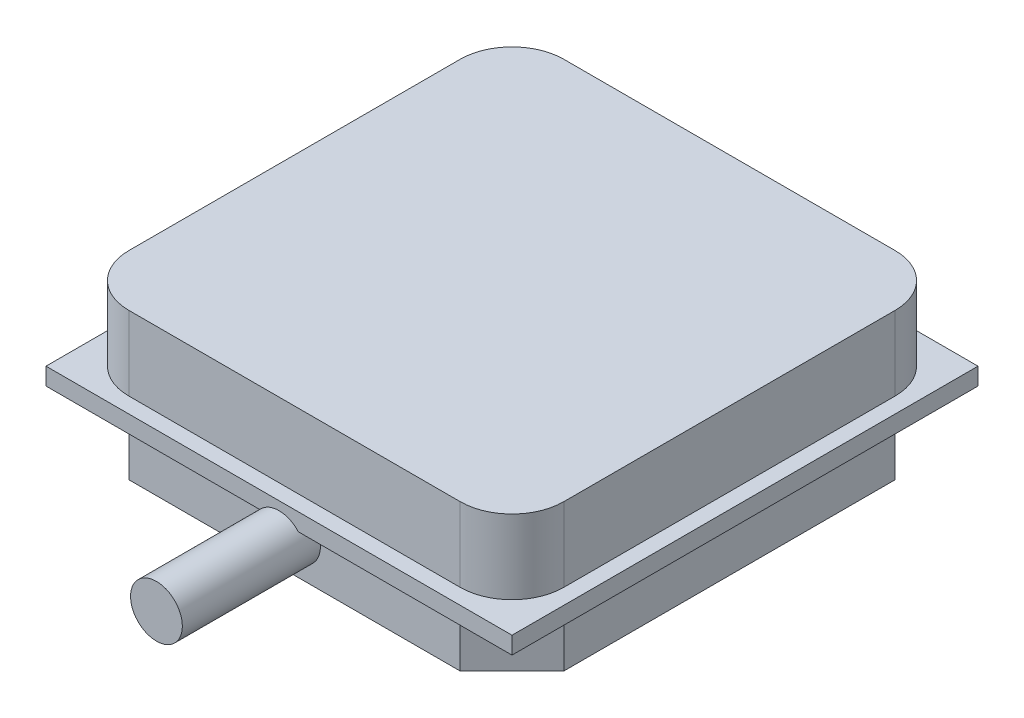
ISO-10303-21;
HEADER;
FILE_DESCRIPTION(('STEP AP214'),'2;1');
FILE_NAME('part.step','',(''),(''),'','','');
FILE_SCHEMA(('AUTOMOTIVE_DESIGN { 1 0 10303 214 1 1 1 1 }'));
ENDSEC;
DATA;
#1=APPLICATION_CONTEXT('core data for automotive mechanical design processes');
#2=APPLICATION_PROTOCOL_DEFINITION('international standard','automotive_design',2000,#1);
#3=PRODUCT_CONTEXT('',#1,'mechanical');
#4=PRODUCT('Part','Part','',(#3));
#5=PRODUCT_RELATED_PRODUCT_CATEGORY('part','',(#4));
#6=PRODUCT_DEFINITION_FORMATION('','',#4);
#7=PRODUCT_DEFINITION_CONTEXT('part definition',#1,'design');
#8=PRODUCT_DEFINITION('design','',#6,#7);
#9=PRODUCT_DEFINITION_SHAPE('','',#8);
#10=(LENGTH_UNIT() NAMED_UNIT(*) SI_UNIT(.MILLI.,.METRE.));
#11=(NAMED_UNIT(*) PLANE_ANGLE_UNIT() SI_UNIT($,.RADIAN.));
#12=(NAMED_UNIT(*) SI_UNIT($,.STERADIAN.) SOLID_ANGLE_UNIT());
#13=UNCERTAINTY_MEASURE_WITH_UNIT(LENGTH_MEASURE(1.E-05),#10,'distance_accuracy_value','');
#14=(GEOMETRIC_REPRESENTATION_CONTEXT(3) GLOBAL_UNCERTAINTY_ASSIGNED_CONTEXT((#13)) GLOBAL_UNIT_ASSIGNED_CONTEXT((#10,
#11,#12)) REPRESENTATION_CONTEXT('',''));
#15=CARTESIAN_POINT('',(0.,0.,0.));
#16=DIRECTION('',(0.,0.,1.));
#17=DIRECTION('',(1.,0.,0.));
#18=AXIS2_PLACEMENT_3D('',#15,#16,#17);
#19=CARTESIAN_POINT('',(0.,0.,-27.));
#20=DIRECTION('',(0.,-1.,0.));
#21=DIRECTION('',(0.,0.,-1.));
#22=AXIS2_PLACEMENT_3D('',#19,#20,#21);
#23=PLANE('',#22);
#24=DIRECTION('',(-1.,0.,0.));
#25=VECTOR('',#24,1.);
#26=CARTESIAN_POINT('',(3.9,0.,-0.899999999999998));
#27=LINE('',#26,#25);
#28=CARTESIAN_POINT('',(12.3819660112501,0.,-0.899999999999998));
#29=VERTEX_POINT('',#28);
#30=CARTESIAN_POINT('',(3.9,0.,-0.899999999999998));
#31=VERTEX_POINT('',#30);
#32=EDGE_CURVE('E193',#29,#31,#27,.T.);
#33=ORIENTED_EDGE('',*,*,#32,.F.);
#34=DIRECTION('',(0.,0.,-1.));
#35=VECTOR('',#34,1.);
#36=CARTESIAN_POINT('',(12.3819660112501,0.,7.1));
#37=LINE('',#36,#35);
#38=CARTESIAN_POINT('',(12.3819660112501,0.,0.));
#39=VERTEX_POINT('',#38);
#40=EDGE_CURVE('E58',#29,#39,#37,.F.);
#41=ORIENTED_EDGE('',*,*,#40,.T.);
#42=DIRECTION('',(1.,0.,0.));
#43=VECTOR('',#42,1.);
#44=CARTESIAN_POINT('',(0.,0.,0.));
#45=LINE('',#44,#43);
#46=CARTESIAN_POINT('',(0.,0.,0.));
#47=VERTEX_POINT('',#46);
#48=EDGE_CURVE('E337',#47,#39,#45,.T.);
#49=ORIENTED_EDGE('',*,*,#48,.F.);
#50=DIRECTION('',(0.,0.,1.));
#51=VECTOR('',#50,1.);
#52=CARTESIAN_POINT('',(0.,0.,0.));
#53=LINE('',#52,#51);
#54=CARTESIAN_POINT('',(0.,0.,-27.));
#55=VERTEX_POINT('',#54);
#56=EDGE_CURVE('E323',#55,#47,#53,.T.);
#57=ORIENTED_EDGE('',*,*,#56,.F.);
#58=DIRECTION('',(-1.,0.,0.));
#59=VECTOR('',#58,1.);
#60=CARTESIAN_POINT('',(0.,0.,-27.));
#61=LINE('',#60,#59);
#62=CARTESIAN_POINT('',(27.,0.,-27.));
#63=VERTEX_POINT('',#62);
#64=EDGE_CURVE('E328',#63,#55,#61,.T.);
#65=ORIENTED_EDGE('',*,*,#64,.F.);
#66=DIRECTION('',(0.,0.,-1.));
#67=VECTOR('',#66,1.);
#68=CARTESIAN_POINT('',(27.,0.,0.));
#69=LINE('',#68,#67);
#70=CARTESIAN_POINT('',(27.,0.,0.));
#71=VERTEX_POINT('',#70);
#72=EDGE_CURVE('E339',#71,#63,#69,.T.);
#73=ORIENTED_EDGE('',*,*,#72,.F.);
#74=CARTESIAN_POINT('',(14.6180339887499,0.,0.));
#75=VERTEX_POINT('',#74);
#76=EDGE_CURVE('E198',#75,#71,#45,.T.);
#77=ORIENTED_EDGE('',*,*,#76,.F.);
#78=DIRECTION('',(0.,0.,-1.));
#79=VECTOR('',#78,1.);
#80=CARTESIAN_POINT('',(14.6180339887499,0.,7.1));
#81=LINE('',#80,#79);
#82=CARTESIAN_POINT('',(14.6180339887499,0.,-0.899999999999998));
#83=VERTEX_POINT('',#82);
#84=EDGE_CURVE('E196',#75,#83,#81,.T.);
#85=ORIENTED_EDGE('',*,*,#84,.T.);
#86=CARTESIAN_POINT('',(23.1,0.,-0.899999999999998));
#87=VERTEX_POINT('',#86);
#88=EDGE_CURVE('E184',#87,#83,#27,.T.);
#89=ORIENTED_EDGE('',*,*,#88,.F.);
#90=DIRECTION('',(-0.707106781186547,0.,0.707106781186548));
#91=VECTOR('',#90,1.);
#92=CARTESIAN_POINT('',(23.1,0.,-0.899999999999998));
#93=LINE('',#92,#91);
#94=CARTESIAN_POINT('',(26.1,0.,-3.9));
#95=VERTEX_POINT('',#94);
#96=EDGE_CURVE('E236',#95,#87,#93,.T.);
#97=ORIENTED_EDGE('',*,*,#96,.F.);
#98=DIRECTION('',(0.,0.,1.));
#99=VECTOR('',#98,1.);
#100=CARTESIAN_POINT('',(26.1,0.,-3.9));
#101=LINE('',#100,#99);
#102=CARTESIAN_POINT('',(26.1,0.,-23.1));
#103=VERTEX_POINT('',#102);
#104=EDGE_CURVE('E234',#103,#95,#101,.T.);
#105=ORIENTED_EDGE('',*,*,#104,.F.);
#106=DIRECTION('',(0.707106781186548,0.,0.707106781186548));
#107=VECTOR('',#106,1.);
#108=CARTESIAN_POINT('',(26.1,0.,-23.1));
#109=LINE('',#108,#107);
#110=CARTESIAN_POINT('',(23.1,0.,-26.1));
#111=VERTEX_POINT('',#110);
#112=EDGE_CURVE('E232',#111,#103,#109,.T.);
#113=ORIENTED_EDGE('',*,*,#112,.F.);
#114=DIRECTION('',(1.,0.,0.));
#115=VECTOR('',#114,1.);
#116=CARTESIAN_POINT('',(3.9,0.,-26.1));
#117=LINE('',#116,#115);
#118=CARTESIAN_POINT('',(3.9,0.,-26.1));
#119=VERTEX_POINT('',#118);
#120=EDGE_CURVE('E230',#119,#111,#117,.T.);
#121=ORIENTED_EDGE('',*,*,#120,.F.);
#122=DIRECTION('',(0.707106781186548,0.,-0.707106781186547));
#123=VECTOR('',#122,1.);
#124=CARTESIAN_POINT('',(0.900000000000003,0.,-23.1));
#125=LINE('',#124,#123);
#126=CARTESIAN_POINT('',(0.900000000000003,0.,-23.1));
#127=VERTEX_POINT('',#126);
#128=EDGE_CURVE('E228',#127,#119,#125,.T.);
#129=ORIENTED_EDGE('',*,*,#128,.F.);
#130=DIRECTION('',(0.,0.,-1.));
#131=VECTOR('',#130,1.);
#132=CARTESIAN_POINT('',(0.9,0.,-3.9));
#133=LINE('',#132,#131);
#134=CARTESIAN_POINT('',(0.9,0.,-3.9));
#135=VERTEX_POINT('',#134);
#136=EDGE_CURVE('E206',#135,#127,#133,.T.);
#137=ORIENTED_EDGE('',*,*,#136,.F.);
#138=DIRECTION('',(-0.707106781186547,0.,-0.707106781186548));
#139=VECTOR('',#138,1.);
#140=CARTESIAN_POINT('',(3.9,0.,-0.899999999999998));
#141=LINE('',#140,#139);
#142=EDGE_CURVE('E203',#31,#135,#141,.T.);
#143=ORIENTED_EDGE('',*,*,#142,.F.);
#144=EDGE_LOOP('',(#33,#41,#49,#57,#65,#73,#77,#85,#89,#97,#105,#113,#121,#129,#137,#143));
#145=FACE_BOUND('',#144,.T.);
#146=ADVANCED_FACE('F35',(#145),#23,.T.);
#147=CARTESIAN_POINT('',(0.,1.,0.));
#148=DIRECTION('',(0.,0.,-1.));
#149=DIRECTION('',(-1.,0.,0.));
#150=AXIS2_PLACEMENT_3D('',#147,#148,#149);
#151=PLANE('',#150);
#152=CARTESIAN_POINT('',(13.5,-1.,0.));
#153=DIRECTION('',(0.,0.,-1.));
#154=DIRECTION('',(-1.,0.,0.));
#155=AXIS2_PLACEMENT_3D('',#152,#153,#154);
#156=CIRCLE('',#155,1.5);
#157=EDGE_CURVE('E50',#75,#39,#156,.F.);
#158=ORIENTED_EDGE('',*,*,#157,.F.);
#159=ORIENTED_EDGE('',*,*,#76,.T.);
#160=DIRECTION('',(0.,-1.,0.));
#161=VECTOR('',#160,1.);
#162=CARTESIAN_POINT('',(27.,1.,0.));
#163=LINE('',#162,#161);
#164=CARTESIAN_POINT('',(27.,1.,0.));
#165=VERTEX_POINT('',#164);
#166=EDGE_CURVE('E347',#165,#71,#163,.T.);
#167=ORIENTED_EDGE('',*,*,#166,.F.);
#168=DIRECTION('',(1.,0.,0.));
#169=VECTOR('',#168,1.);
#170=CARTESIAN_POINT('',(0.,1.,0.));
#171=LINE('',#170,#169);
#172=CARTESIAN_POINT('',(0.,1.,0.));
#173=VERTEX_POINT('',#172);
#174=EDGE_CURVE('E327',#173,#165,#171,.T.);
#175=ORIENTED_EDGE('',*,*,#174,.F.);
#176=DIRECTION('',(0.,-1.,0.));
#177=VECTOR('',#176,1.);
#178=CARTESIAN_POINT('',(0.,1.,0.));
#179=LINE('',#178,#177);
#180=EDGE_CURVE('E43',#173,#47,#179,.T.);
#181=ORIENTED_EDGE('',*,*,#180,.T.);
#182=ORIENTED_EDGE('',*,*,#48,.T.);
#183=EDGE_LOOP('',(#158,#159,#167,#175,#181,#182));
#184=FACE_BOUND('',#183,.T.);
#185=ADVANCED_FACE('F351',(#184),#151,.F.);
#186=CARTESIAN_POINT('',(3.9,-3.2,-0.899999999999998));
#187=DIRECTION('',(0.,0.,-1.));
#188=DIRECTION('',(-1.,0.,0.));
#189=AXIS2_PLACEMENT_3D('',#186,#187,#188);
#190=PLANE('',#189);
#191=CARTESIAN_POINT('',(13.5,-1.,-0.899999999999998));
#192=DIRECTION('',(0.,0.,-1.));
#193=DIRECTION('',(-1.,0.,0.));
#194=AXIS2_PLACEMENT_3D('',#191,#192,#193);
#195=CIRCLE('',#194,1.5);
#196=EDGE_CURVE('E11',#29,#83,#195,.F.);
#197=ORIENTED_EDGE('',*,*,#196,.F.);
#198=ORIENTED_EDGE('',*,*,#32,.T.);
#199=DIRECTION('',(0.,1.,0.));
#200=VECTOR('',#199,1.);
#201=CARTESIAN_POINT('',(3.9,-3.2,-0.899999999999998));
#202=LINE('',#201,#200);
#203=CARTESIAN_POINT('',(3.9,-3.2,-0.899999999999998));
#204=VERTEX_POINT('',#203);
#205=EDGE_CURVE('E225',#204,#31,#202,.T.);
#206=ORIENTED_EDGE('',*,*,#205,.F.);
#207=DIRECTION('',(-1.,0.,0.));
#208=VECTOR('',#207,1.);
#209=CARTESIAN_POINT('',(3.9,-3.2,-0.899999999999998));
#210=LINE('',#209,#208);
#211=CARTESIAN_POINT('',(23.1,-3.2,-0.899999999999998));
#212=VERTEX_POINT('',#211);
#213=EDGE_CURVE('E224',#212,#204,#210,.T.);
#214=ORIENTED_EDGE('',*,*,#213,.F.);
#215=DIRECTION('',(0.,1.,0.));
#216=VECTOR('',#215,1.);
#217=CARTESIAN_POINT('',(23.1,-3.2,-0.899999999999998));
#218=LINE('',#217,#216);
#219=EDGE_CURVE('E189',#212,#87,#218,.T.);
#220=ORIENTED_EDGE('',*,*,#219,.T.);
#221=ORIENTED_EDGE('',*,*,#88,.T.);
#222=EDGE_LOOP('',(#197,#198,#206,#214,#220,#221));
#223=FACE_BOUND('',#222,.T.);
#224=ADVANCED_FACE('F186',(#223),#190,.F.);
#225=CARTESIAN_POINT('',(0.,1.,-27.));
#226=DIRECTION('',(0.,-1.,0.));
#227=DIRECTION('',(0.,0.,-1.));
#228=AXIS2_PLACEMENT_3D('',#225,#226,#227);
#229=PLANE('',#228);
#230=DIRECTION('',(0.,0.,1.));
#231=VECTOR('',#230,1.);
#232=CARTESIAN_POINT('',(0.,1.,0.));
#233=LINE('',#232,#231);
#234=CARTESIAN_POINT('',(0.,1.,-27.));
#235=VERTEX_POINT('',#234);
#236=EDGE_CURVE('E324',#235,#173,#233,.T.);
#237=ORIENTED_EDGE('',*,*,#236,.T.);
#238=ORIENTED_EDGE('',*,*,#174,.T.);
#239=DIRECTION('',(0.,0.,-1.));
#240=VECTOR('',#239,1.);
#241=CARTESIAN_POINT('',(27.,1.,0.));
#242=LINE('',#241,#240);
#243=CARTESIAN_POINT('',(27.,1.,-27.));
#244=VERTEX_POINT('',#243);
#245=EDGE_CURVE('E330',#165,#244,#242,.T.);
#246=ORIENTED_EDGE('',*,*,#245,.T.);
#247=DIRECTION('',(-1.,0.,0.));
#248=VECTOR('',#247,1.);
#249=CARTESIAN_POINT('',(0.,1.,-27.));
#250=LINE('',#249,#248);
#251=EDGE_CURVE('E332',#244,#235,#250,.T.);
#252=ORIENTED_EDGE('',*,*,#251,.T.);
#253=EDGE_LOOP('',(#237,#238,#246,#252));
#254=FACE_BOUND('',#253,.T.);
#255=CARTESIAN_POINT('',(3.9,1.,-3.9));
#256=DIRECTION('',(0.,1.,0.));
#257=DIRECTION('',(0.,0.,1.));
#258=AXIS2_PLACEMENT_3D('',#255,#256,#257);
#259=CIRCLE('',#258,3.);
#260=CARTESIAN_POINT('',(0.900000000000002,1.,-3.9));
#261=VERTEX_POINT('',#260);
#262=CARTESIAN_POINT('',(3.9,1.,-0.900000000000001));
#263=VERTEX_POINT('',#262);
#264=EDGE_CURVE('E258',#261,#263,#259,.T.);
#265=ORIENTED_EDGE('',*,*,#264,.F.);
#266=DIRECTION('',(0.,0.,1.));
#267=VECTOR('',#266,1.);
#268=CARTESIAN_POINT('',(0.9,1.,-23.1));
#269=LINE('',#268,#267);
#270=CARTESIAN_POINT('',(0.9,1.,-23.1));
#271=VERTEX_POINT('',#270);
#272=EDGE_CURVE('E263',#271,#261,#269,.T.);
#273=ORIENTED_EDGE('',*,*,#272,.F.);
#274=CARTESIAN_POINT('',(3.9,1.,-23.1));
#275=DIRECTION('',(0.,1.,0.));
#276=DIRECTION('',(0.,0.,1.));
#277=AXIS2_PLACEMENT_3D('',#274,#275,#276);
#278=CIRCLE('',#277,3.);
#279=CARTESIAN_POINT('',(3.9,1.,-26.1));
#280=VERTEX_POINT('',#279);
#281=EDGE_CURVE('E295',#280,#271,#278,.T.);
#282=ORIENTED_EDGE('',*,*,#281,.F.);
#283=DIRECTION('',(-1.,0.,0.));
#284=VECTOR('',#283,1.);
#285=CARTESIAN_POINT('',(3.9,1.,-26.1));
#286=LINE('',#285,#284);
#287=CARTESIAN_POINT('',(23.1,1.,-26.1));
#288=VERTEX_POINT('',#287);
#289=EDGE_CURVE('E292',#288,#280,#286,.T.);
#290=ORIENTED_EDGE('',*,*,#289,.F.);
#291=CARTESIAN_POINT('',(23.1,1.,-23.1));
#292=DIRECTION('',(0.,1.,0.));
#293=DIRECTION('',(0.,0.,-1.));
#294=AXIS2_PLACEMENT_3D('',#291,#292,#293);
#295=CIRCLE('',#294,3.);
#296=CARTESIAN_POINT('',(26.1,1.,-23.1));
#297=VERTEX_POINT('',#296);
#298=EDGE_CURVE('E289',#297,#288,#295,.T.);
#299=ORIENTED_EDGE('',*,*,#298,.F.);
#300=DIRECTION('',(0.,0.,-1.));
#301=VECTOR('',#300,1.);
#302=CARTESIAN_POINT('',(26.1,1.,-23.1));
#303=LINE('',#302,#301);
#304=CARTESIAN_POINT('',(26.1,1.,-3.9));
#305=VERTEX_POINT('',#304);
#306=EDGE_CURVE('E286',#305,#297,#303,.T.);
#307=ORIENTED_EDGE('',*,*,#306,.F.);
#308=CARTESIAN_POINT('',(23.1,1.,-3.9));
#309=DIRECTION('',(0.,1.,0.));
#310=DIRECTION('',(0.,0.,1.));
#311=AXIS2_PLACEMENT_3D('',#308,#309,#310);
#312=CIRCLE('',#311,3.);
#313=CARTESIAN_POINT('',(23.1,1.,-0.899999999999999));
#314=VERTEX_POINT('',#313);
#315=EDGE_CURVE('E283',#314,#305,#312,.T.);
#316=ORIENTED_EDGE('',*,*,#315,.F.);
#317=DIRECTION('',(1.,0.,0.));
#318=VECTOR('',#317,1.);
#319=CARTESIAN_POINT('',(3.9,1.,-0.9));
#320=LINE('',#319,#318);
#321=EDGE_CURVE('E280',#263,#314,#320,.T.);
#322=ORIENTED_EDGE('',*,*,#321,.F.);
#323=EDGE_LOOP('',(#265,#273,#282,#290,#299,#307,#316,#322));
#324=FACE_BOUND('',#323,.T.);
#325=ADVANCED_FACE('F366',(#254,#324),#229,.F.);
#326=CARTESIAN_POINT('',(0.,1.,0.));
#327=DIRECTION('',(1.,0.,0.));
#328=DIRECTION('',(0.,0.,-1.));
#329=AXIS2_PLACEMENT_3D('',#326,#327,#328);
#330=PLANE('',#329);
#331=ORIENTED_EDGE('',*,*,#56,.T.);
#332=ORIENTED_EDGE('',*,*,#180,.F.);
#333=ORIENTED_EDGE('',*,*,#236,.F.);
#334=DIRECTION('',(0.,-1.,0.));
#335=VECTOR('',#334,1.);
#336=CARTESIAN_POINT('',(0.,1.,-27.));
#337=LINE('',#336,#335);
#338=EDGE_CURVE('E334',#235,#55,#337,.T.);
#339=ORIENTED_EDGE('',*,*,#338,.T.);
#340=EDGE_LOOP('',(#331,#332,#333,#339));
#341=FACE_BOUND('',#340,.T.);
#342=ADVANCED_FACE('F37',(#341),#330,.F.);
#343=CARTESIAN_POINT('',(27.,1.,0.));
#344=DIRECTION('',(-1.,0.,0.));
#345=DIRECTION('',(0.,0.,1.));
#346=AXIS2_PLACEMENT_3D('',#343,#344,#345);
#347=PLANE('',#346);
#348=ORIENTED_EDGE('',*,*,#72,.T.);
#349=DIRECTION('',(0.,-1.,0.));
#350=VECTOR('',#349,1.);
#351=CARTESIAN_POINT('',(27.,1.,-27.));
#352=LINE('',#351,#350);
#353=EDGE_CURVE('E344',#244,#63,#352,.T.);
#354=ORIENTED_EDGE('',*,*,#353,.F.);
#355=ORIENTED_EDGE('',*,*,#245,.F.);
#356=ORIENTED_EDGE('',*,*,#166,.T.);
#357=EDGE_LOOP('',(#348,#354,#355,#356));
#358=FACE_BOUND('',#357,.T.);
#359=ADVANCED_FACE('F364',(#358),#347,.F.);
#360=CARTESIAN_POINT('',(0.,1.,-27.));
#361=DIRECTION('',(0.,0.,1.));
#362=DIRECTION('',(1.,0.,0.));
#363=AXIS2_PLACEMENT_3D('',#360,#361,#362);
#364=PLANE('',#363);
#365=ORIENTED_EDGE('',*,*,#64,.T.);
#366=ORIENTED_EDGE('',*,*,#338,.F.);
#367=ORIENTED_EDGE('',*,*,#251,.F.);
#368=ORIENTED_EDGE('',*,*,#353,.T.);
#369=EDGE_LOOP('',(#365,#366,#367,#368));
#370=FACE_BOUND('',#369,.T.);
#371=ADVANCED_FACE('F359',(#370),#364,.F.);
#372=CARTESIAN_POINT('',(3.9,5.3,-3.9));
#373=DIRECTION('',(0.,-1.,0.));
#374=DIRECTION('',(0.,0.,-1.));
#375=AXIS2_PLACEMENT_3D('',#372,#373,#374);
#376=CYLINDRICAL_SURFACE('',#375,3.);
#377=ORIENTED_EDGE('',*,*,#264,.T.);
#378=DIRECTION('',(0.,-1.,0.));
#379=VECTOR('',#378,1.);
#380=CARTESIAN_POINT('',(3.9,5.3,-0.9));
#381=LINE('',#380,#379);
#382=CARTESIAN_POINT('',(3.9,5.3,-0.9));
#383=VERTEX_POINT('',#382);
#384=EDGE_CURVE('E320',#383,#263,#381,.T.);
#385=ORIENTED_EDGE('',*,*,#384,.F.);
#386=CARTESIAN_POINT('',(3.9,5.3,-3.9));
#387=DIRECTION('',(0.,1.,0.));
#388=DIRECTION('',(0.,0.,1.));
#389=AXIS2_PLACEMENT_3D('',#386,#387,#388);
#390=CIRCLE('',#389,3.);
#391=CARTESIAN_POINT('',(0.900000000000002,5.3,-3.9));
#392=VERTEX_POINT('',#391);
#393=EDGE_CURVE('E259',#392,#383,#390,.T.);
#394=ORIENTED_EDGE('',*,*,#393,.F.);
#395=DIRECTION('',(0.,-1.,0.));
#396=VECTOR('',#395,1.);
#397=CARTESIAN_POINT('',(0.900000000000002,5.3,-3.9));
#398=LINE('',#397,#396);
#399=EDGE_CURVE('E277',#392,#261,#398,.T.);
#400=ORIENTED_EDGE('',*,*,#399,.T.);
#401=EDGE_LOOP('',(#377,#385,#394,#400));
#402=FACE_BOUND('',#401,.T.);
#403=ADVANCED_FACE('F378',(#402),#376,.T.);
#404=CARTESIAN_POINT('',(3.9,5.3,-0.9));
#405=DIRECTION('',(0.,0.,-1.));
#406=DIRECTION('',(-1.,0.,0.));
#407=AXIS2_PLACEMENT_3D('',#404,#405,#406);
#408=PLANE('',#407);
#409=ORIENTED_EDGE('',*,*,#321,.T.);
#410=DIRECTION('',(0.,-1.,0.));
#411=VECTOR('',#410,1.);
#412=CARTESIAN_POINT('',(23.1,5.3,-0.899999999999999));
#413=LINE('',#412,#411);
#414=CARTESIAN_POINT('',(23.1,5.3,-0.899999999999999));
#415=VERTEX_POINT('',#414);
#416=EDGE_CURVE('E317',#415,#314,#413,.T.);
#417=ORIENTED_EDGE('',*,*,#416,.F.);
#418=DIRECTION('',(1.,0.,0.));
#419=VECTOR('',#418,1.);
#420=CARTESIAN_POINT('',(3.9,5.3,-0.9));
#421=LINE('',#420,#419);
#422=EDGE_CURVE('E262',#383,#415,#421,.T.);
#423=ORIENTED_EDGE('',*,*,#422,.F.);
#424=ORIENTED_EDGE('',*,*,#384,.T.);
#425=EDGE_LOOP('',(#409,#417,#423,#424));
#426=FACE_BOUND('',#425,.T.);
#427=ADVANCED_FACE('F402',(#426),#408,.F.);
#428=CARTESIAN_POINT('',(23.1,5.3,-3.9));
#429=DIRECTION('',(0.,-1.,0.));
#430=DIRECTION('',(0.,0.,-1.));
#431=AXIS2_PLACEMENT_3D('',#428,#429,#430);
#432=CYLINDRICAL_SURFACE('',#431,3.);
#433=ORIENTED_EDGE('',*,*,#315,.T.);
#434=DIRECTION('',(0.,-1.,0.));
#435=VECTOR('',#434,1.);
#436=CARTESIAN_POINT('',(26.1,5.3,-3.9));
#437=LINE('',#436,#435);
#438=CARTESIAN_POINT('',(26.1,5.3,-3.9));
#439=VERTEX_POINT('',#438);
#440=EDGE_CURVE('E314',#439,#305,#437,.T.);
#441=ORIENTED_EDGE('',*,*,#440,.F.);
#442=CARTESIAN_POINT('',(23.1,5.3,-3.9));
#443=DIRECTION('',(0.,1.,0.));
#444=DIRECTION('',(0.,0.,1.));
#445=AXIS2_PLACEMENT_3D('',#442,#443,#444);
#446=CIRCLE('',#445,3.);
#447=EDGE_CURVE('E265',#415,#439,#446,.T.);
#448=ORIENTED_EDGE('',*,*,#447,.F.);
#449=ORIENTED_EDGE('',*,*,#416,.T.);
#450=EDGE_LOOP('',(#433,#441,#448,#449));
#451=FACE_BOUND('',#450,.T.);
#452=ADVANCED_FACE('F400',(#451),#432,.T.);
#453=CARTESIAN_POINT('',(26.1,5.3,-23.1));
#454=DIRECTION('',(-1.,0.,0.));
#455=DIRECTION('',(0.,0.,1.));
#456=AXIS2_PLACEMENT_3D('',#453,#454,#455);
#457=PLANE('',#456);
#458=ORIENTED_EDGE('',*,*,#306,.T.);
#459=DIRECTION('',(0.,-1.,0.));
#460=VECTOR('',#459,1.);
#461=CARTESIAN_POINT('',(26.1,5.3,-23.1));
#462=LINE('',#461,#460);
#463=CARTESIAN_POINT('',(26.1,5.3,-23.1));
#464=VERTEX_POINT('',#463);
#465=EDGE_CURVE('E311',#464,#297,#462,.T.);
#466=ORIENTED_EDGE('',*,*,#465,.F.);
#467=DIRECTION('',(0.,0.,-1.));
#468=VECTOR('',#467,1.);
#469=CARTESIAN_POINT('',(26.1,5.3,-23.1));
#470=LINE('',#469,#468);
#471=EDGE_CURVE('E267',#439,#464,#470,.T.);
#472=ORIENTED_EDGE('',*,*,#471,.F.);
#473=ORIENTED_EDGE('',*,*,#440,.T.);
#474=EDGE_LOOP('',(#458,#466,#472,#473));
#475=FACE_BOUND('',#474,.T.);
#476=ADVANCED_FACE('F395',(#475),#457,.F.);
#477=CARTESIAN_POINT('',(23.1,5.3,-23.1));
#478=DIRECTION('',(0.,-1.,0.));
#479=DIRECTION('',(0.,0.,-1.));
#480=AXIS2_PLACEMENT_3D('',#477,#478,#479);
#481=CYLINDRICAL_SURFACE('',#480,3.);
#482=ORIENTED_EDGE('',*,*,#298,.T.);
#483=DIRECTION('',(0.,-1.,0.));
#484=VECTOR('',#483,1.);
#485=CARTESIAN_POINT('',(23.1,5.3,-26.1));
#486=LINE('',#485,#484);
#487=CARTESIAN_POINT('',(23.1,5.3,-26.1));
#488=VERTEX_POINT('',#487);
#489=EDGE_CURVE('E308',#488,#288,#486,.T.);
#490=ORIENTED_EDGE('',*,*,#489,.F.);
#491=CARTESIAN_POINT('',(23.1,5.3,-23.1));
#492=DIRECTION('',(0.,1.,0.));
#493=DIRECTION('',(0.,0.,-1.));
#494=AXIS2_PLACEMENT_3D('',#491,#492,#493);
#495=CIRCLE('',#494,3.);
#496=EDGE_CURVE('E269',#464,#488,#495,.T.);
#497=ORIENTED_EDGE('',*,*,#496,.F.);
#498=ORIENTED_EDGE('',*,*,#465,.T.);
#499=EDGE_LOOP('',(#482,#490,#497,#498));
#500=FACE_BOUND('',#499,.T.);
#501=ADVANCED_FACE('F392',(#500),#481,.T.);
#502=CARTESIAN_POINT('',(3.9,5.3,-26.1));
#503=DIRECTION('',(0.,0.,1.));
#504=DIRECTION('',(1.,0.,0.));
#505=AXIS2_PLACEMENT_3D('',#502,#503,#504);
#506=PLANE('',#505);
#507=ORIENTED_EDGE('',*,*,#289,.T.);
#508=DIRECTION('',(0.,-1.,0.));
#509=VECTOR('',#508,1.);
#510=CARTESIAN_POINT('',(3.9,5.3,-26.1));
#511=LINE('',#510,#509);
#512=CARTESIAN_POINT('',(3.9,5.3,-26.1));
#513=VERTEX_POINT('',#512);
#514=EDGE_CURVE('E305',#513,#280,#511,.T.);
#515=ORIENTED_EDGE('',*,*,#514,.F.);
#516=DIRECTION('',(-1.,0.,0.));
#517=VECTOR('',#516,1.);
#518=CARTESIAN_POINT('',(3.9,5.3,-26.1));
#519=LINE('',#518,#517);
#520=EDGE_CURVE('E271',#488,#513,#519,.T.);
#521=ORIENTED_EDGE('',*,*,#520,.F.);
#522=ORIENTED_EDGE('',*,*,#489,.T.);
#523=EDGE_LOOP('',(#507,#515,#521,#522));
#524=FACE_BOUND('',#523,.T.);
#525=ADVANCED_FACE('F388',(#524),#506,.F.);
#526=CARTESIAN_POINT('',(3.9,5.3,-23.1));
#527=DIRECTION('',(0.,-1.,0.));
#528=DIRECTION('',(0.,0.,-1.));
#529=AXIS2_PLACEMENT_3D('',#526,#527,#528);
#530=CYLINDRICAL_SURFACE('',#529,3.);
#531=ORIENTED_EDGE('',*,*,#281,.T.);
#532=DIRECTION('',(0.,-1.,0.));
#533=VECTOR('',#532,1.);
#534=CARTESIAN_POINT('',(0.9,5.3,-23.1));
#535=LINE('',#534,#533);
#536=CARTESIAN_POINT('',(0.9,5.3,-23.1));
#537=VERTEX_POINT('',#536);
#538=EDGE_CURVE('E302',#537,#271,#535,.T.);
#539=ORIENTED_EDGE('',*,*,#538,.F.);
#540=CARTESIAN_POINT('',(3.9,5.3,-23.1));
#541=DIRECTION('',(0.,1.,0.));
#542=DIRECTION('',(0.,0.,1.));
#543=AXIS2_PLACEMENT_3D('',#540,#541,#542);
#544=CIRCLE('',#543,3.);
#545=EDGE_CURVE('E273',#513,#537,#544,.T.);
#546=ORIENTED_EDGE('',*,*,#545,.F.);
#547=ORIENTED_EDGE('',*,*,#514,.T.);
#548=EDGE_LOOP('',(#531,#539,#546,#547));
#549=FACE_BOUND('',#548,.T.);
#550=ADVANCED_FACE('F386',(#549),#530,.T.);
#551=CARTESIAN_POINT('',(0.9,5.3,-23.1));
#552=DIRECTION('',(1.,0.,0.));
#553=DIRECTION('',(0.,0.,-1.));
#554=AXIS2_PLACEMENT_3D('',#551,#552,#553);
#555=PLANE('',#554);
#556=ORIENTED_EDGE('',*,*,#272,.T.);
#557=ORIENTED_EDGE('',*,*,#399,.F.);
#558=DIRECTION('',(0.,0.,1.));
#559=VECTOR('',#558,1.);
#560=CARTESIAN_POINT('',(0.9,5.3,-23.1));
#561=LINE('',#560,#559);
#562=EDGE_CURVE('E275',#537,#392,#561,.T.);
#563=ORIENTED_EDGE('',*,*,#562,.F.);
#564=ORIENTED_EDGE('',*,*,#538,.T.);
#565=EDGE_LOOP('',(#556,#557,#563,#564));
#566=FACE_BOUND('',#565,.T.);
#567=ADVANCED_FACE('F374',(#566),#555,.F.);
#568=CARTESIAN_POINT('',(3.9,5.3,-3.9));
#569=DIRECTION('',(0.,1.,0.));
#570=DIRECTION('',(0.,0.,1.));
#571=AXIS2_PLACEMENT_3D('',#568,#569,#570);
#572=PLANE('',#571);
#573=ORIENTED_EDGE('',*,*,#393,.T.);
#574=ORIENTED_EDGE('',*,*,#422,.T.);
#575=ORIENTED_EDGE('',*,*,#447,.T.);
#576=ORIENTED_EDGE('',*,*,#471,.T.);
#577=ORIENTED_EDGE('',*,*,#496,.T.);
#578=ORIENTED_EDGE('',*,*,#520,.T.);
#579=ORIENTED_EDGE('',*,*,#545,.T.);
#580=ORIENTED_EDGE('',*,*,#562,.T.);
#581=EDGE_LOOP('',(#573,#574,#575,#576,#577,#578,#579,#580));
#582=FACE_BOUND('',#581,.T.);
#583=ADVANCED_FACE('F380',(#582),#572,.T.);
#584=CARTESIAN_POINT('',(3.9,-3.2,-0.899999999999998));
#585=DIRECTION('',(0.707106781186548,0.,-0.707106781186548));
#586=DIRECTION('',(-0.707106781186548,0.,-0.707106781186548));
#587=AXIS2_PLACEMENT_3D('',#584,#585,#586);
#588=PLANE('',#587);
#589=ORIENTED_EDGE('',*,*,#142,.T.);
#590=DIRECTION('',(0.,1.,0.));
#591=VECTOR('',#590,1.);
#592=CARTESIAN_POINT('',(0.9,-3.2,-3.9));
#593=LINE('',#592,#591);
#594=CARTESIAN_POINT('',(0.9,-3.2,-3.9));
#595=VERTEX_POINT('',#594);
#596=EDGE_CURVE('E256',#595,#135,#593,.T.);
#597=ORIENTED_EDGE('',*,*,#596,.F.);
#598=DIRECTION('',(-0.707106781186547,0.,-0.707106781186548));
#599=VECTOR('',#598,1.);
#600=CARTESIAN_POINT('',(3.9,-3.2,-0.899999999999998));
#601=LINE('',#600,#599);
#602=EDGE_CURVE('E192',#204,#595,#601,.T.);
#603=ORIENTED_EDGE('',*,*,#602,.F.);
#604=ORIENTED_EDGE('',*,*,#205,.T.);
#605=EDGE_LOOP('',(#589,#597,#603,#604));
#606=FACE_BOUND('',#605,.T.);
#607=ADVANCED_FACE('F518',(#606),#588,.F.);
#608=CARTESIAN_POINT('',(0.9,-3.2,-3.9));
#609=DIRECTION('',(1.,0.,0.));
#610=DIRECTION('',(0.,0.,-1.));
#611=AXIS2_PLACEMENT_3D('',#608,#609,#610);
#612=PLANE('',#611);
#613=ORIENTED_EDGE('',*,*,#136,.T.);
#614=DIRECTION('',(0.,1.,0.));
#615=VECTOR('',#614,1.);
#616=CARTESIAN_POINT('',(0.900000000000003,-3.2,-23.1));
#617=LINE('',#616,#615);
#618=CARTESIAN_POINT('',(0.900000000000003,-3.2,-23.1));
#619=VERTEX_POINT('',#618);
#620=EDGE_CURVE('E253',#619,#127,#617,.T.);
#621=ORIENTED_EDGE('',*,*,#620,.F.);
#622=DIRECTION('',(0.,0.,-1.));
#623=VECTOR('',#622,1.);
#624=CARTESIAN_POINT('',(0.9,-3.2,-3.9));
#625=LINE('',#624,#623);
#626=EDGE_CURVE('E212',#595,#619,#625,.T.);
#627=ORIENTED_EDGE('',*,*,#626,.F.);
#628=ORIENTED_EDGE('',*,*,#596,.T.);
#629=EDGE_LOOP('',(#613,#621,#627,#628));
#630=FACE_BOUND('',#629,.T.);
#631=ADVANCED_FACE('F508',(#630),#612,.F.);
#632=CARTESIAN_POINT('',(0.900000000000003,-3.2,-23.1));
#633=DIRECTION('',(0.707106781186547,0.,0.707106781186548));
#634=DIRECTION('',(0.707106781186548,0.,-0.707106781186547));
#635=AXIS2_PLACEMENT_3D('',#632,#633,#634);
#636=PLANE('',#635);
#637=ORIENTED_EDGE('',*,*,#128,.T.);
#638=DIRECTION('',(0.,1.,0.));
#639=VECTOR('',#638,1.);
#640=CARTESIAN_POINT('',(3.9,-3.2,-26.1));
#641=LINE('',#640,#639);
#642=CARTESIAN_POINT('',(3.9,-3.2,-26.1));
#643=VERTEX_POINT('',#642);
#644=EDGE_CURVE('E250',#643,#119,#641,.T.);
#645=ORIENTED_EDGE('',*,*,#644,.F.);
#646=DIRECTION('',(0.707106781186548,0.,-0.707106781186547));
#647=VECTOR('',#646,1.);
#648=CARTESIAN_POINT('',(0.900000000000003,-3.2,-23.1));
#649=LINE('',#648,#647);
#650=EDGE_CURVE('E214',#619,#643,#649,.T.);
#651=ORIENTED_EDGE('',*,*,#650,.F.);
#652=ORIENTED_EDGE('',*,*,#620,.T.);
#653=EDGE_LOOP('',(#637,#645,#651,#652));
#654=FACE_BOUND('',#653,.T.);
#655=ADVANCED_FACE('F498',(#654),#636,.F.);
#656=CARTESIAN_POINT('',(3.9,-3.2,-26.1));
#657=DIRECTION('',(0.,0.,1.));
#658=DIRECTION('',(1.,0.,0.));
#659=AXIS2_PLACEMENT_3D('',#656,#657,#658);
#660=PLANE('',#659);
#661=ORIENTED_EDGE('',*,*,#120,.T.);
#662=DIRECTION('',(0.,1.,0.));
#663=VECTOR('',#662,1.);
#664=CARTESIAN_POINT('',(23.1,-3.2,-26.1));
#665=LINE('',#664,#663);
#666=CARTESIAN_POINT('',(23.1,-3.2,-26.1));
#667=VERTEX_POINT('',#666);
#668=EDGE_CURVE('E247',#667,#111,#665,.T.);
#669=ORIENTED_EDGE('',*,*,#668,.F.);
#670=DIRECTION('',(1.,0.,0.));
#671=VECTOR('',#670,1.);
#672=CARTESIAN_POINT('',(3.9,-3.2,-26.1));
#673=LINE('',#672,#671);
#674=EDGE_CURVE('E216',#643,#667,#673,.T.);
#675=ORIENTED_EDGE('',*,*,#674,.F.);
#676=ORIENTED_EDGE('',*,*,#644,.T.);
#677=EDGE_LOOP('',(#661,#669,#675,#676));
#678=FACE_BOUND('',#677,.T.);
#679=ADVANCED_FACE('F488',(#678),#660,.F.);
#680=CARTESIAN_POINT('',(26.1,-3.2,-23.1));
#681=DIRECTION('',(-0.707106781186548,0.,0.707106781186548));
#682=DIRECTION('',(0.707106781186548,0.,0.707106781186548));
#683=AXIS2_PLACEMENT_3D('',#680,#681,#682);
#684=PLANE('',#683);
#685=ORIENTED_EDGE('',*,*,#112,.T.);
#686=DIRECTION('',(0.,1.,0.));
#687=VECTOR('',#686,1.);
#688=CARTESIAN_POINT('',(26.1,-3.2,-23.1));
#689=LINE('',#688,#687);
#690=CARTESIAN_POINT('',(26.1,-3.2,-23.1));
#691=VERTEX_POINT('',#690);
#692=EDGE_CURVE('E244',#691,#103,#689,.T.);
#693=ORIENTED_EDGE('',*,*,#692,.F.);
#694=DIRECTION('',(0.707106781186548,0.,0.707106781186548));
#695=VECTOR('',#694,1.);
#696=CARTESIAN_POINT('',(26.1,-3.2,-23.1));
#697=LINE('',#696,#695);
#698=EDGE_CURVE('E218',#667,#691,#697,.T.);
#699=ORIENTED_EDGE('',*,*,#698,.F.);
#700=ORIENTED_EDGE('',*,*,#668,.T.);
#701=EDGE_LOOP('',(#685,#693,#699,#700));
#702=FACE_BOUND('',#701,.T.);
#703=ADVANCED_FACE('F478',(#702),#684,.F.);
#704=CARTESIAN_POINT('',(26.1,-3.2,-3.9));
#705=DIRECTION('',(-1.,0.,0.));
#706=DIRECTION('',(0.,0.,1.));
#707=AXIS2_PLACEMENT_3D('',#704,#705,#706);
#708=PLANE('',#707);
#709=ORIENTED_EDGE('',*,*,#104,.T.);
#710=DIRECTION('',(0.,1.,0.));
#711=VECTOR('',#710,1.);
#712=CARTESIAN_POINT('',(26.1,-3.2,-3.9));
#713=LINE('',#712,#711);
#714=CARTESIAN_POINT('',(26.1,-3.2,-3.9));
#715=VERTEX_POINT('',#714);
#716=EDGE_CURVE('E241',#715,#95,#713,.T.);
#717=ORIENTED_EDGE('',*,*,#716,.F.);
#718=DIRECTION('',(0.,0.,1.));
#719=VECTOR('',#718,1.);
#720=CARTESIAN_POINT('',(26.1,-3.2,-3.9));
#721=LINE('',#720,#719);
#722=EDGE_CURVE('E220',#691,#715,#721,.T.);
#723=ORIENTED_EDGE('',*,*,#722,.F.);
#724=ORIENTED_EDGE('',*,*,#692,.T.);
#725=EDGE_LOOP('',(#709,#717,#723,#724));
#726=FACE_BOUND('',#725,.T.);
#727=ADVANCED_FACE('F468',(#726),#708,.F.);
#728=CARTESIAN_POINT('',(23.1,-3.2,-0.899999999999998));
#729=DIRECTION('',(-0.707106781186548,0.,-0.707106781186547));
#730=DIRECTION('',(-0.707106781186547,0.,0.707106781186548));
#731=AXIS2_PLACEMENT_3D('',#728,#729,#730);
#732=PLANE('',#731);
#733=ORIENTED_EDGE('',*,*,#96,.T.);
#734=ORIENTED_EDGE('',*,*,#219,.F.);
#735=DIRECTION('',(-0.707106781186547,0.,0.707106781186548));
#736=VECTOR('',#735,1.);
#737=CARTESIAN_POINT('',(23.1,-3.2,-0.899999999999998));
#738=LINE('',#737,#736);
#739=EDGE_CURVE('E222',#715,#212,#738,.T.);
#740=ORIENTED_EDGE('',*,*,#739,.F.);
#741=ORIENTED_EDGE('',*,*,#716,.T.);
#742=EDGE_LOOP('',(#733,#734,#740,#741));
#743=FACE_BOUND('',#742,.T.);
#744=ADVANCED_FACE('F457',(#743),#732,.F.);
#745=CARTESIAN_POINT('',(-8.7,-3.2,-13.5));
#746=DIRECTION('',(0.,-1.,0.));
#747=DIRECTION('',(0.,0.,-1.));
#748=AXIS2_PLACEMENT_3D('',#745,#746,#747);
#749=PLANE('',#748);
#750=ORIENTED_EDGE('',*,*,#602,.T.);
#751=ORIENTED_EDGE('',*,*,#626,.T.);
#752=ORIENTED_EDGE('',*,*,#650,.T.);
#753=ORIENTED_EDGE('',*,*,#674,.T.);
#754=ORIENTED_EDGE('',*,*,#698,.T.);
#755=ORIENTED_EDGE('',*,*,#722,.T.);
#756=ORIENTED_EDGE('',*,*,#739,.T.);
#757=ORIENTED_EDGE('',*,*,#213,.T.);
#758=EDGE_LOOP('',(#750,#751,#752,#753,#754,#755,#756,#757));
#759=FACE_BOUND('',#758,.T.);
#760=ADVANCED_FACE('F452',(#759),#749,.T.);
#761=CARTESIAN_POINT('',(13.5,-1.,7.1));
#762=DIRECTION('',(0.,0.,-1.));
#763=DIRECTION('',(-1.,0.,0.));
#764=AXIS2_PLACEMENT_3D('',#761,#762,#763);
#765=CYLINDRICAL_SURFACE('',#764,1.5);
#766=ORIENTED_EDGE('',*,*,#40,.F.);
#767=ORIENTED_EDGE('',*,*,#196,.T.);
#768=ORIENTED_EDGE('',*,*,#84,.F.);
#769=ORIENTED_EDGE('',*,*,#157,.T.);
#770=EDGE_LOOP('',(#766,#767,#768,#769));
#771=FACE_BOUND('',#770,.T.);
#772=CARTESIAN_POINT('',(13.5,-1.,7.1));
#773=DIRECTION('',(0.,0.,1.));
#774=DIRECTION('',(1.,0.,0.));
#775=AXIS2_PLACEMENT_3D('',#772,#773,#774);
#776=CIRCLE('',#775,1.5);
#777=CARTESIAN_POINT('',(15.,-1.,7.1));
#778=VERTEX_POINT('',#777);
#779=EDGE_CURVE('E617',#778,#778,#776,.T.);
#780=ORIENTED_EDGE('',*,*,#779,.F.);
#781=EDGE_LOOP('',(#780));
#782=FACE_BOUND('',#781,.T.);
#783=ADVANCED_FACE('F201',(#771,#782),#765,.T.);
#784=CARTESIAN_POINT('',(13.5,-1.,7.1));
#785=DIRECTION('',(0.,0.,1.));
#786=DIRECTION('',(1.,0.,0.));
#787=AXIS2_PLACEMENT_3D('',#784,#785,#786);
#788=PLANE('',#787);
#789=ORIENTED_EDGE('',*,*,#779,.T.);
#790=EDGE_LOOP('',(#789));
#791=FACE_BOUND('',#790,.T.);
#792=ADVANCED_FACE('F610',(#791),#788,.T.);
#793=CLOSED_SHELL('',(#146,#185,#224,#325,#342,#359,#371,#403,#427,#452,#476,#501,#525,#550,
#567,#583,#607,#631,#655,#679,#703,#727,#744,#760,#783,#792));
#794=MANIFOLD_SOLID_BREP('B2',#793);
#795=ADVANCED_BREP_SHAPE_REPRESENTATION('',(#18,#794),#14);
#796=SHAPE_DEFINITION_REPRESENTATION(#9,#795);
ENDSEC;
END-ISO-10303-21;
